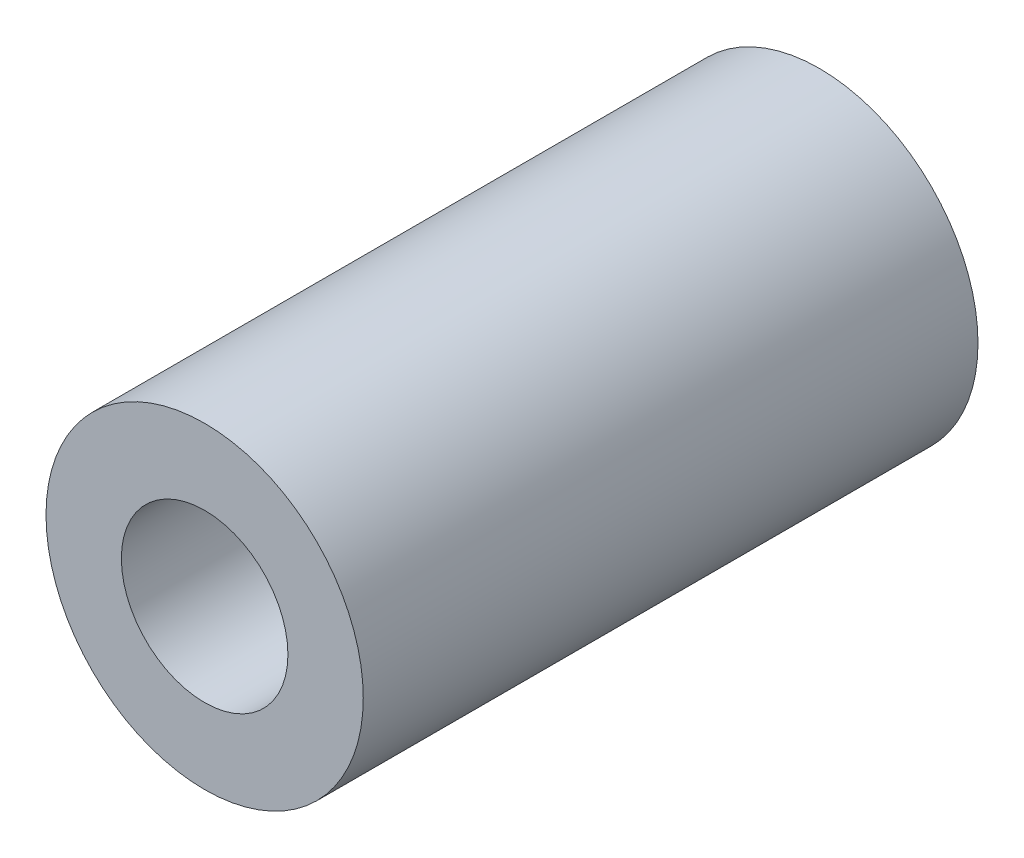
ISO-10303-21;
HEADER;
FILE_DESCRIPTION(('STEP AP214'),'2;1');
FILE_NAME('part.step','',(''),(''),'','','');
FILE_SCHEMA(('AUTOMOTIVE_DESIGN { 1 0 10303 214 1 1 1 1 }'));
ENDSEC;
DATA;
#1=APPLICATION_CONTEXT('core data for automotive mechanical design processes');
#2=APPLICATION_PROTOCOL_DEFINITION('international standard','automotive_design',2000,#1);
#3=PRODUCT_CONTEXT('',#1,'mechanical');
#4=PRODUCT('Part','Part','',(#3));
#5=PRODUCT_RELATED_PRODUCT_CATEGORY('part','',(#4));
#6=PRODUCT_DEFINITION_FORMATION('','',#4);
#7=PRODUCT_DEFINITION_CONTEXT('part definition',#1,'design');
#8=PRODUCT_DEFINITION('design','',#6,#7);
#9=PRODUCT_DEFINITION_SHAPE('','',#8);
#10=(LENGTH_UNIT() NAMED_UNIT(*) SI_UNIT(.MILLI.,.METRE.));
#11=(NAMED_UNIT(*) PLANE_ANGLE_UNIT() SI_UNIT($,.RADIAN.));
#12=(NAMED_UNIT(*) SI_UNIT($,.STERADIAN.) SOLID_ANGLE_UNIT());
#13=UNCERTAINTY_MEASURE_WITH_UNIT(LENGTH_MEASURE(1.E-05),#10,'distance_accuracy_value','');
#14=(GEOMETRIC_REPRESENTATION_CONTEXT(3) GLOBAL_UNCERTAINTY_ASSIGNED_CONTEXT((#13)) GLOBAL_UNIT_ASSIGNED_CONTEXT((#10,
#11,#12)) REPRESENTATION_CONTEXT('',''));
#15=CARTESIAN_POINT('',(0.,0.,0.));
#16=DIRECTION('',(0.,0.,1.));
#17=DIRECTION('',(1.,0.,0.));
#18=AXIS2_PLACEMENT_3D('',#15,#16,#17);
#19=CARTESIAN_POINT('',(0.,0.,15.5));
#20=DIRECTION('',(0.,0.,1.));
#21=DIRECTION('',(1.,0.,0.));
#22=AXIS2_PLACEMENT_3D('',#19,#20,#21);
#23=PLANE('',#22);
#24=CARTESIAN_POINT('',(0.,0.,15.5));
#25=DIRECTION('',(0.,0.,1.));
#26=DIRECTION('',(1.,0.,0.));
#27=AXIS2_PLACEMENT_3D('',#24,#25,#26);
#28=CIRCLE('',#27,4.);
#29=CARTESIAN_POINT('',(4.,0.,15.5));
#30=VERTEX_POINT('',#29);
#31=EDGE_CURVE('E10',#30,#30,#28,.T.);
#32=ORIENTED_EDGE('',*,*,#31,.T.);
#33=EDGE_LOOP('',(#32));
#34=FACE_BOUND('',#33,.T.);
#35=CARTESIAN_POINT('',(0.,0.,15.5));
#36=DIRECTION('',(0.,0.,1.));
#37=DIRECTION('',(1.,0.,0.));
#38=AXIS2_PLACEMENT_3D('',#35,#36,#37);
#39=CIRCLE('',#38,2.1);
#40=CARTESIAN_POINT('',(2.1,0.,15.5));
#41=VERTEX_POINT('',#40);
#42=EDGE_CURVE('E42',#41,#41,#39,.T.);
#43=ORIENTED_EDGE('',*,*,#42,.F.);
#44=EDGE_LOOP('',(#43));
#45=FACE_BOUND('',#44,.T.);
#46=ADVANCED_FACE('F31',(#34,#45),#23,.T.);
#47=CARTESIAN_POINT('',(0.,0.,0.));
#48=DIRECTION('',(0.,0.,1.));
#49=DIRECTION('',(1.,0.,0.));
#50=AXIS2_PLACEMENT_3D('',#47,#48,#49);
#51=PLANE('',#50);
#52=CARTESIAN_POINT('',(0.,0.,0.));
#53=DIRECTION('',(0.,0.,1.));
#54=DIRECTION('',(1.,0.,0.));
#55=AXIS2_PLACEMENT_3D('',#52,#53,#54);
#56=CIRCLE('',#55,4.);
#57=CARTESIAN_POINT('',(4.,0.,0.));
#58=VERTEX_POINT('',#57);
#59=EDGE_CURVE('E35',#58,#58,#56,.T.);
#60=ORIENTED_EDGE('',*,*,#59,.F.);
#61=EDGE_LOOP('',(#60));
#62=FACE_BOUND('',#61,.T.);
#63=CARTESIAN_POINT('',(0.,0.,0.));
#64=DIRECTION('',(0.,0.,1.));
#65=DIRECTION('',(1.,0.,0.));
#66=AXIS2_PLACEMENT_3D('',#63,#64,#65);
#67=CIRCLE('',#66,2.1);
#68=CARTESIAN_POINT('',(2.1,0.,0.));
#69=VERTEX_POINT('',#68);
#70=EDGE_CURVE('E44',#69,#69,#67,.T.);
#71=ORIENTED_EDGE('',*,*,#70,.T.);
#72=EDGE_LOOP('',(#71));
#73=FACE_BOUND('',#72,.T.);
#74=ADVANCED_FACE('F54',(#62,#73),#51,.F.);
#75=CARTESIAN_POINT('',(0.,0.,15.5));
#76=DIRECTION('',(0.,0.,-1.));
#77=DIRECTION('',(-1.,0.,0.));
#78=AXIS2_PLACEMENT_3D('',#75,#76,#77);
#79=CYLINDRICAL_SURFACE('',#78,4.);
#80=ORIENTED_EDGE('',*,*,#31,.F.);
#81=EDGE_LOOP('',(#80));
#82=FACE_BOUND('',#81,.T.);
#83=ORIENTED_EDGE('',*,*,#59,.T.);
#84=EDGE_LOOP('',(#83));
#85=FACE_BOUND('',#84,.T.);
#86=ADVANCED_FACE('F33',(#82,#85),#79,.T.);
#87=CARTESIAN_POINT('',(0.,0.,15.5));
#88=DIRECTION('',(0.,0.,-1.));
#89=DIRECTION('',(-1.,0.,0.));
#90=AXIS2_PLACEMENT_3D('',#87,#88,#89);
#91=CYLINDRICAL_SURFACE('',#90,2.1);
#92=ORIENTED_EDGE('',*,*,#42,.T.);
#93=EDGE_LOOP('',(#92));
#94=FACE_BOUND('',#93,.T.);
#95=ORIENTED_EDGE('',*,*,#70,.F.);
#96=EDGE_LOOP('',(#95));
#97=FACE_BOUND('',#96,.T.);
#98=ADVANCED_FACE('F50',(#94,#97),#91,.F.);
#99=CLOSED_SHELL('',(#46,#74,#86,#98));
#100=MANIFOLD_SOLID_BREP('B2',#99);
#101=ADVANCED_BREP_SHAPE_REPRESENTATION('',(#18,#100),#14);
#102=SHAPE_DEFINITION_REPRESENTATION(#9,#101);
ENDSEC;
END-ISO-10303-21;
